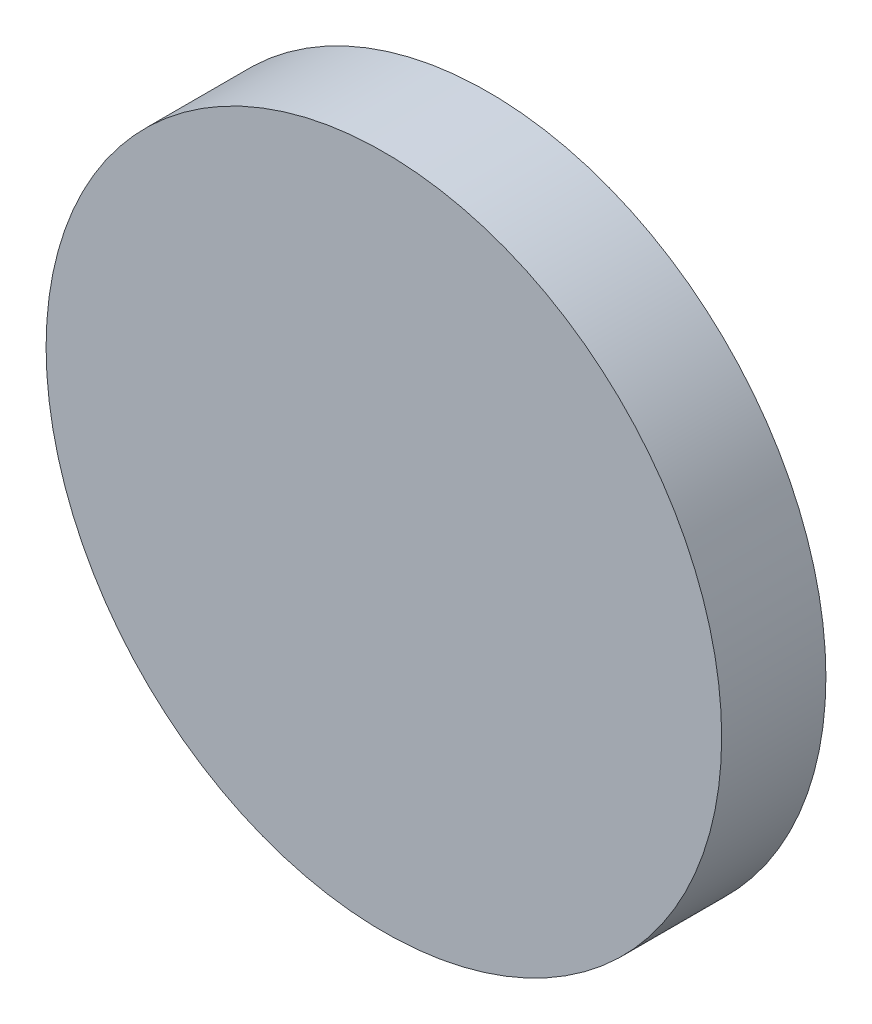
ISO-10303-21;
HEADER;
FILE_DESCRIPTION(('STEP AP214'),'2;1');
FILE_NAME('part.step','',(''),(''),'','','');
FILE_SCHEMA(('AUTOMOTIVE_DESIGN { 1 0 10303 214 1 1 1 1 }'));
ENDSEC;
DATA;
#1=APPLICATION_CONTEXT('core data for automotive mechanical design processes');
#2=APPLICATION_PROTOCOL_DEFINITION('international standard','automotive_design',2000,#1);
#3=PRODUCT_CONTEXT('',#1,'mechanical');
#4=PRODUCT('Part','Part','',(#3));
#5=PRODUCT_RELATED_PRODUCT_CATEGORY('part','',(#4));
#6=PRODUCT_DEFINITION_FORMATION('','',#4);
#7=PRODUCT_DEFINITION_CONTEXT('part definition',#1,'design');
#8=PRODUCT_DEFINITION('design','',#6,#7);
#9=PRODUCT_DEFINITION_SHAPE('','',#8);
#10=(LENGTH_UNIT() NAMED_UNIT(*) SI_UNIT(.MILLI.,.METRE.));
#11=(NAMED_UNIT(*) PLANE_ANGLE_UNIT() SI_UNIT($,.RADIAN.));
#12=(NAMED_UNIT(*) SI_UNIT($,.STERADIAN.) SOLID_ANGLE_UNIT());
#13=UNCERTAINTY_MEASURE_WITH_UNIT(LENGTH_MEASURE(1.E-05),#10,'distance_accuracy_value','');
#14=(GEOMETRIC_REPRESENTATION_CONTEXT(3) GLOBAL_UNCERTAINTY_ASSIGNED_CONTEXT((#13)) GLOBAL_UNIT_ASSIGNED_CONTEXT((#10,
#11,#12)) REPRESENTATION_CONTEXT('',''));
#15=CARTESIAN_POINT('',(0.,0.,0.));
#16=DIRECTION('',(0.,0.,1.));
#17=DIRECTION('',(1.,0.,0.));
#18=AXIS2_PLACEMENT_3D('',#15,#16,#17);
#19=CARTESIAN_POINT('',(0.,0.,10.8));
#20=DIRECTION('',(0.,0.,-1.));
#21=DIRECTION('',(-1.,0.,0.));
#22=AXIS2_PLACEMENT_3D('',#19,#20,#21);
#23=CYLINDRICAL_SURFACE('',#22,35.);
#24=CARTESIAN_POINT('',(0.,0.,10.8));
#25=DIRECTION('',(0.,0.,-1.));
#26=DIRECTION('',(1.,0.,0.));
#27=AXIS2_PLACEMENT_3D('',#24,#25,#26);
#28=CIRCLE('',#27,35.);
#29=CARTESIAN_POINT('',(35.,0.,10.8));
#30=VERTEX_POINT('',#29);
#31=EDGE_CURVE('E10',#30,#30,#28,.T.);
#32=ORIENTED_EDGE('',*,*,#31,.T.);
#33=EDGE_LOOP('',(#32));
#34=FACE_BOUND('',#33,.T.);
#35=CARTESIAN_POINT('',(0.,0.,0.));
#36=DIRECTION('',(0.,0.,-1.));
#37=DIRECTION('',(1.,0.,0.));
#38=AXIS2_PLACEMENT_3D('',#35,#36,#37);
#39=CIRCLE('',#38,35.);
#40=CARTESIAN_POINT('',(35.,0.,0.));
#41=VERTEX_POINT('',#40);
#42=EDGE_CURVE('E18',#41,#41,#39,.T.);
#43=ORIENTED_EDGE('',*,*,#42,.F.);
#44=EDGE_LOOP('',(#43));
#45=FACE_BOUND('',#44,.T.);
#46=ADVANCED_FACE('F15',(#34,#45),#23,.T.);
#47=CARTESIAN_POINT('',(0.,0.,10.8));
#48=DIRECTION('',(0.,0.,-1.));
#49=DIRECTION('',(-1.,0.,0.));
#50=AXIS2_PLACEMENT_3D('',#47,#48,#49);
#51=PLANE('',#50);
#52=ORIENTED_EDGE('',*,*,#31,.F.);
#53=EDGE_LOOP('',(#52));
#54=FACE_BOUND('',#53,.T.);
#55=ADVANCED_FACE('F33',(#54),#51,.F.);
#56=CARTESIAN_POINT('',(0.,0.,0.));
#57=DIRECTION('',(0.,0.,-1.));
#58=DIRECTION('',(-1.,0.,0.));
#59=AXIS2_PLACEMENT_3D('',#56,#57,#58);
#60=PLANE('',#59);
#61=ORIENTED_EDGE('',*,*,#42,.T.);
#62=EDGE_LOOP('',(#61));
#63=FACE_BOUND('',#62,.T.);
#64=ADVANCED_FACE('F30',(#63),#60,.T.);
#65=CLOSED_SHELL('',(#46,#55,#64));
#66=MANIFOLD_SOLID_BREP('B1',#65);
#67=ADVANCED_BREP_SHAPE_REPRESENTATION('',(#18,#66),#14);
#68=SHAPE_DEFINITION_REPRESENTATION(#9,#67);
ENDSEC;
END-ISO-10303-21;
